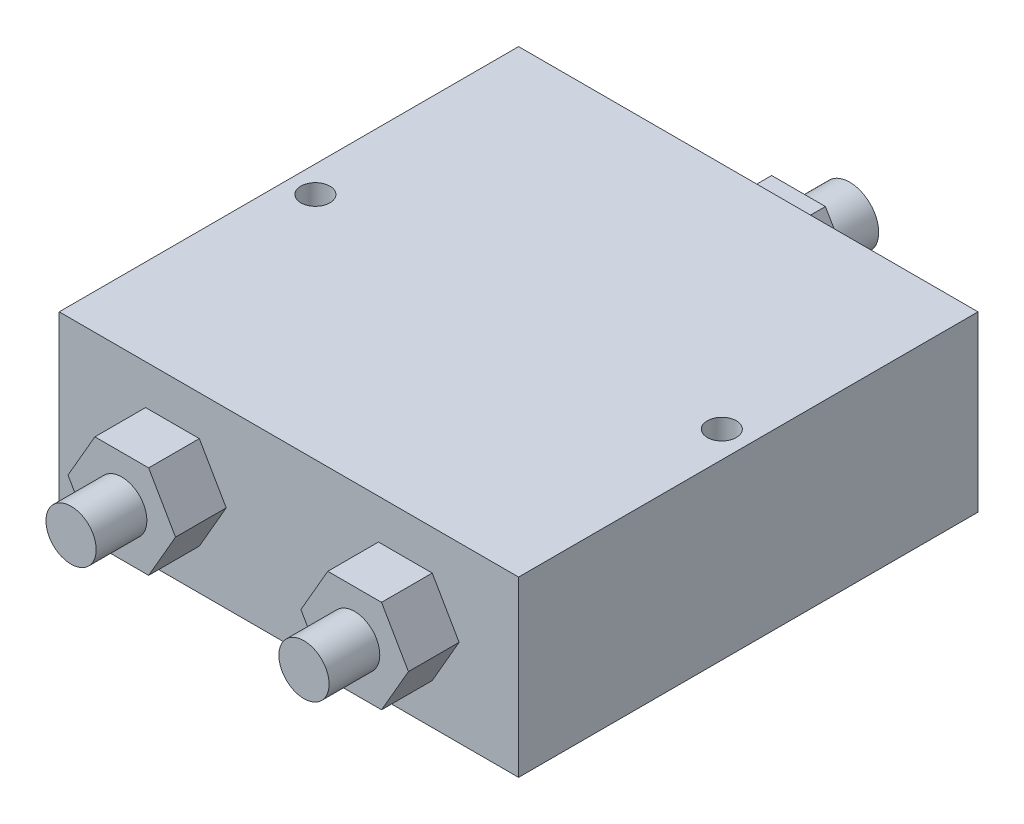
ISO-10303-21;
HEADER;
FILE_DESCRIPTION(('STEP AP214'),'2;1');
FILE_NAME('part.step','',(''),(''),'','','');
FILE_SCHEMA(('AUTOMOTIVE_DESIGN { 1 0 10303 214 1 1 1 1 }'));
ENDSEC;
DATA;
#1=APPLICATION_CONTEXT('core data for automotive mechanical design processes');
#2=APPLICATION_PROTOCOL_DEFINITION('international standard','automotive_design',2000,#1);
#3=PRODUCT_CONTEXT('',#1,'mechanical');
#4=PRODUCT('Part','Part','',(#3));
#5=PRODUCT_RELATED_PRODUCT_CATEGORY('part','',(#4));
#6=PRODUCT_DEFINITION_FORMATION('','',#4);
#7=PRODUCT_DEFINITION_CONTEXT('part definition',#1,'design');
#8=PRODUCT_DEFINITION('design','',#6,#7);
#9=PRODUCT_DEFINITION_SHAPE('','',#8);
#10=(LENGTH_UNIT() NAMED_UNIT(*) SI_UNIT(.MILLI.,.METRE.));
#11=(NAMED_UNIT(*) PLANE_ANGLE_UNIT() SI_UNIT($,.RADIAN.));
#12=(NAMED_UNIT(*) SI_UNIT($,.STERADIAN.) SOLID_ANGLE_UNIT());
#13=UNCERTAINTY_MEASURE_WITH_UNIT(LENGTH_MEASURE(1.E-05),#10,'distance_accuracy_value','');
#14=(GEOMETRIC_REPRESENTATION_CONTEXT(3) GLOBAL_UNCERTAINTY_ASSIGNED_CONTEXT((#13)) GLOBAL_UNIT_ASSIGNED_CONTEXT((#10,
#11,#12)) REPRESENTATION_CONTEXT('',''));
#15=CARTESIAN_POINT('',(0.,0.,0.));
#16=DIRECTION('',(0.,0.,1.));
#17=DIRECTION('',(1.,0.,0.));
#18=AXIS2_PLACEMENT_3D('',#15,#16,#17);
#19=CARTESIAN_POINT('',(0.,19.,0.));
#20=DIRECTION('',(0.,1.,0.));
#21=DIRECTION('',(0.,0.,1.));
#22=AXIS2_PLACEMENT_3D('',#19,#20,#21);
#23=PLANE('',#22);
#24=DIRECTION('',(0.,0.,1.));
#25=VECTOR('',#24,1.);
#26=CARTESIAN_POINT('',(-25.15,19.,25.15));
#27=LINE('',#26,#25);
#28=CARTESIAN_POINT('',(-25.15,19.,-25.15));
#29=VERTEX_POINT('',#28);
#30=CARTESIAN_POINT('',(-25.15,19.,25.15));
#31=VERTEX_POINT('',#30);
#32=EDGE_CURVE('E309',#29,#31,#27,.T.);
#33=ORIENTED_EDGE('',*,*,#32,.T.);
#34=DIRECTION('',(1.,0.,0.));
#35=VECTOR('',#34,1.);
#36=CARTESIAN_POINT('',(25.15,19.,25.15));
#37=LINE('',#36,#35);
#38=CARTESIAN_POINT('',(25.15,19.,25.15));
#39=VERTEX_POINT('',#38);
#40=EDGE_CURVE('E312',#31,#39,#37,.T.);
#41=ORIENTED_EDGE('',*,*,#40,.T.);
#42=DIRECTION('',(0.,0.,-1.));
#43=VECTOR('',#42,1.);
#44=CARTESIAN_POINT('',(25.15,19.,25.15));
#45=LINE('',#44,#43);
#46=CARTESIAN_POINT('',(25.15,19.,-25.15));
#47=VERTEX_POINT('',#46);
#48=EDGE_CURVE('E315',#39,#47,#45,.T.);
#49=ORIENTED_EDGE('',*,*,#48,.T.);
#50=DIRECTION('',(-1.,0.,0.));
#51=VECTOR('',#50,1.);
#52=CARTESIAN_POINT('',(25.15,19.,-25.15));
#53=LINE('',#52,#51);
#54=EDGE_CURVE('E317',#47,#29,#53,.T.);
#55=ORIENTED_EDGE('',*,*,#54,.T.);
#56=EDGE_LOOP('',(#33,#41,#49,#55));
#57=FACE_BOUND('',#56,.T.);
#58=CARTESIAN_POINT('',(-22.25,19.,0.));
#59=DIRECTION('',(0.,1.,0.));
#60=DIRECTION('',(0.,0.,1.));
#61=AXIS2_PLACEMENT_3D('',#58,#59,#60);
#62=CIRCLE('',#61,1.59);
#63=CARTESIAN_POINT('',(-22.25,19.,1.59));
#64=VERTEX_POINT('',#63);
#65=EDGE_CURVE('E363',#64,#64,#62,.T.);
#66=ORIENTED_EDGE('',*,*,#65,.F.);
#67=EDGE_LOOP('',(#66));
#68=FACE_BOUND('',#67,.T.);
#69=CARTESIAN_POINT('',(22.25,19.,0.));
#70=DIRECTION('',(0.,-1.,0.));
#71=DIRECTION('',(0.,0.,-1.));
#72=AXIS2_PLACEMENT_3D('',#69,#70,#71);
#73=CIRCLE('',#72,1.59);
#74=CARTESIAN_POINT('',(22.25,19.,-1.59));
#75=VERTEX_POINT('',#74);
#76=EDGE_CURVE('E366',#75,#75,#73,.T.);
#77=ORIENTED_EDGE('',*,*,#76,.T.);
#78=EDGE_LOOP('',(#77));
#79=FACE_BOUND('',#78,.T.);
#80=ADVANCED_FACE('F34',(#57,#68,#79),#23,.T.);
#81=CARTESIAN_POINT('',(0.,0.,0.));
#82=DIRECTION('',(0.,1.,0.));
#83=DIRECTION('',(0.,0.,1.));
#84=AXIS2_PLACEMENT_3D('',#81,#82,#83);
#85=PLANE('',#84);
#86=DIRECTION('',(0.,0.,1.));
#87=VECTOR('',#86,1.);
#88=CARTESIAN_POINT('',(-25.15,0.,25.15));
#89=LINE('',#88,#87);
#90=CARTESIAN_POINT('',(-25.15,0.,-25.15));
#91=VERTEX_POINT('',#90);
#92=CARTESIAN_POINT('',(-25.15,0.,25.15));
#93=VERTEX_POINT('',#92);
#94=EDGE_CURVE('E308',#91,#93,#89,.T.);
#95=ORIENTED_EDGE('',*,*,#94,.F.);
#96=DIRECTION('',(-1.,0.,0.));
#97=VECTOR('',#96,1.);
#98=CARTESIAN_POINT('',(25.15,0.,-25.15));
#99=LINE('',#98,#97);
#100=CARTESIAN_POINT('',(25.15,0.,-25.15));
#101=VERTEX_POINT('',#100);
#102=EDGE_CURVE('E313',#101,#91,#99,.T.);
#103=ORIENTED_EDGE('',*,*,#102,.F.);
#104=DIRECTION('',(0.,0.,-1.));
#105=VECTOR('',#104,1.);
#106=CARTESIAN_POINT('',(25.15,0.,25.15));
#107=LINE('',#106,#105);
#108=CARTESIAN_POINT('',(25.15,0.,25.15));
#109=VERTEX_POINT('',#108);
#110=EDGE_CURVE('E324',#109,#101,#107,.T.);
#111=ORIENTED_EDGE('',*,*,#110,.F.);
#112=DIRECTION('',(1.,0.,0.));
#113=VECTOR('',#112,1.);
#114=CARTESIAN_POINT('',(25.15,0.,25.15));
#115=LINE('',#114,#113);
#116=EDGE_CURVE('E322',#93,#109,#115,.T.);
#117=ORIENTED_EDGE('',*,*,#116,.F.);
#118=EDGE_LOOP('',(#95,#103,#111,#117));
#119=FACE_BOUND('',#118,.T.);
#120=CARTESIAN_POINT('',(-22.25,0.,0.));
#121=DIRECTION('',(0.,1.,0.));
#122=DIRECTION('',(0.,0.,1.));
#123=AXIS2_PLACEMENT_3D('',#120,#121,#122);
#124=CIRCLE('',#123,1.59);
#125=CARTESIAN_POINT('',(-22.25,0.,1.59));
#126=VERTEX_POINT('',#125);
#127=EDGE_CURVE('E370',#126,#126,#124,.T.);
#128=ORIENTED_EDGE('',*,*,#127,.T.);
#129=EDGE_LOOP('',(#128));
#130=FACE_BOUND('',#129,.T.);
#131=CARTESIAN_POINT('',(22.25,0.,0.));
#132=DIRECTION('',(0.,-1.,0.));
#133=DIRECTION('',(0.,0.,-1.));
#134=AXIS2_PLACEMENT_3D('',#131,#132,#133);
#135=CIRCLE('',#134,1.59);
#136=CARTESIAN_POINT('',(22.25,0.,-1.59));
#137=VERTEX_POINT('',#136);
#138=EDGE_CURVE('E368',#137,#137,#135,.T.);
#139=ORIENTED_EDGE('',*,*,#138,.F.);
#140=EDGE_LOOP('',(#139));
#141=FACE_BOUND('',#140,.T.);
#142=ADVANCED_FACE('F346',(#119,#130,#141),#85,.F.);
#143=CARTESIAN_POINT('',(0.,0.,30.7));
#144=DIRECTION('',(0.,0.,1.));
#145=DIRECTION('',(1.,0.,0.));
#146=AXIS2_PLACEMENT_3D('',#143,#144,#145);
#147=PLANE('',#146);
#148=DIRECTION('',(-0.5,-0.866025403784439,0.));
#149=VECTOR('',#148,1.);
#150=CARTESIAN_POINT('',(-18.112863606784,10.4574666791717,30.7));
#151=LINE('',#150,#149);
#152=CARTESIAN_POINT('',(-15.6928784028185,14.6490040060048,30.7));
#153=VERTEX_POINT('',#152);
#154=CARTESIAN_POINT('',(-18.6357568056371,9.55178909182594,30.7));
#155=VERTEX_POINT('',#154);
#156=EDGE_CURVE('E260',#153,#155,#151,.T.);
#157=ORIENTED_EDGE('',*,*,#156,.T.);
#158=DIRECTION('',(0.500000000000001,-0.866025403784438,0.));
#159=VECTOR('',#158,1.);
#160=CARTESIAN_POINT('',(-9.84077160167162,-5.68157213325874,30.7));
#161=LINE('',#160,#159);
#162=CARTESIAN_POINT('',(-15.6928784028185,4.45457417764707,30.7));
#163=VERTEX_POINT('',#162);
#164=EDGE_CURVE('E263',#155,#163,#161,.T.);
#165=ORIENTED_EDGE('',*,*,#164,.T.);
#166=DIRECTION('',(1.,0.,0.));
#167=VECTOR('',#166,1.);
#168=CARTESIAN_POINT('',(0.,4.45457417764707,30.7));
#169=LINE('',#168,#167);
#170=CARTESIAN_POINT('',(-9.80712159718144,4.45457417764707,30.7));
#171=VERTEX_POINT('',#170);
#172=EDGE_CURVE('E266',#163,#171,#169,.T.);
#173=ORIENTED_EDGE('',*,*,#172,.T.);
#174=DIRECTION('',(0.5,0.866025403784439,0.));
#175=VECTOR('',#174,1.);
#176=CARTESIAN_POINT('',(-9.28422839832835,5.36025176499284,30.7));
#177=LINE('',#176,#175);
#178=CARTESIAN_POINT('',(-6.86424319436289,9.55178909182595,30.7));
#179=VERTEX_POINT('',#178);
#180=EDGE_CURVE('E268',#171,#179,#177,.T.);
#181=ORIENTED_EDGE('',*,*,#180,.T.);
#182=DIRECTION('',(-0.5,0.866025403784438,0.));
#183=VECTOR('',#182,1.);
#184=CARTESIAN_POINT('',(-1.01213639321598,-0.584357219079866,30.7));
#185=LINE('',#184,#183);
#186=CARTESIAN_POINT('',(-9.80712159718144,14.6490040060048,30.7));
#187=VERTEX_POINT('',#186);
#188=EDGE_CURVE('E270',#179,#187,#185,.T.);
#189=ORIENTED_EDGE('',*,*,#188,.T.);
#190=DIRECTION('',(-1.,0.,0.));
#191=VECTOR('',#190,1.);
#192=CARTESIAN_POINT('',(0.,14.6490040060048,30.7));
#193=LINE('',#192,#191);
#194=EDGE_CURVE('E272',#187,#153,#193,.T.);
#195=ORIENTED_EDGE('',*,*,#194,.T.);
#196=EDGE_LOOP('',(#157,#165,#173,#181,#189,#195));
#197=FACE_BOUND('',#196,.T.);
#198=CARTESIAN_POINT('',(-12.7507568056371,9.56400400600482,30.7));
#199=DIRECTION('',(0.,0.,1.));
#200=DIRECTION('',(1.,0.,0.));
#201=AXIS2_PLACEMENT_3D('',#198,#199,#200);
#202=CIRCLE('',#201,2.75);
#203=CARTESIAN_POINT('',(-10.0007568056371,9.56400400600482,30.7));
#204=VERTEX_POINT('',#203);
#205=EDGE_CURVE('E380',#204,#204,#202,.T.);
#206=ORIENTED_EDGE('',*,*,#205,.F.);
#207=EDGE_LOOP('',(#206));
#208=FACE_BOUND('',#207,.T.);
#209=ADVANCED_FACE('F437',(#197,#208),#147,.T.);
#210=CARTESIAN_POINT('',(0.,0.,-30.7));
#211=DIRECTION('',(0.,0.,-1.));
#212=DIRECTION('',(-1.,0.,0.));
#213=AXIS2_PLACEMENT_3D('',#210,#211,#212);
#214=PLANE('',#213);
#215=DIRECTION('',(0.5,-0.866025403784439,0.));
#216=VECTOR('',#215,1.);
#217=CARTESIAN_POINT('',(2.89275432205953,15.0813788669719,-30.7));
#218=LINE('',#217,#216);
#219=CARTESIAN_POINT('',(2.89275432205953,15.0813788669719,-30.7));
#220=VERTEX_POINT('',#219);
#221=CARTESIAN_POINT('',(5.83550864411906,9.98437886697185,-30.7));
#222=VERTEX_POINT('',#221);
#223=EDGE_CURVE('E191',#220,#222,#218,.T.);
#224=ORIENTED_EDGE('',*,*,#223,.T.);
#225=DIRECTION('',(-0.5,-0.866025403784439,0.));
#226=VECTOR('',#225,1.);
#227=CARTESIAN_POINT('',(5.83550864411906,9.98437886697185,-30.7));
#228=LINE('',#227,#226);
#229=CARTESIAN_POINT('',(2.89275432205953,4.88737886697185,-30.7));
#230=VERTEX_POINT('',#229);
#231=EDGE_CURVE('E180',#222,#230,#228,.T.);
#232=ORIENTED_EDGE('',*,*,#231,.T.);
#233=DIRECTION('',(-1.,0.,0.));
#234=VECTOR('',#233,1.);
#235=CARTESIAN_POINT('',(2.89275432205953,4.88737886697185,-30.7));
#236=LINE('',#235,#234);
#237=CARTESIAN_POINT('',(-2.99275432205951,4.88737886697185,-30.7));
#238=VERTEX_POINT('',#237);
#239=EDGE_CURVE('E190',#230,#238,#236,.T.);
#240=ORIENTED_EDGE('',*,*,#239,.T.);
#241=DIRECTION('',(-0.5,0.866025403784439,0.));
#242=VECTOR('',#241,1.);
#243=CARTESIAN_POINT('',(-2.99275432205951,4.88737886697185,-30.7));
#244=LINE('',#243,#242);
#245=CARTESIAN_POINT('',(-5.93550864411904,9.98437886697186,-30.7));
#246=VERTEX_POINT('',#245);
#247=EDGE_CURVE('E393',#238,#246,#244,.T.);
#248=ORIENTED_EDGE('',*,*,#247,.T.);
#249=DIRECTION('',(0.5,0.866025403784439,0.));
#250=VECTOR('',#249,1.);
#251=CARTESIAN_POINT('',(-5.93550864411904,9.98437886697186,-30.7));
#252=LINE('',#251,#250);
#253=CARTESIAN_POINT('',(-2.99275432205951,15.0813788669719,-30.7));
#254=VERTEX_POINT('',#253);
#255=EDGE_CURVE('E395',#246,#254,#252,.T.);
#256=ORIENTED_EDGE('',*,*,#255,.T.);
#257=DIRECTION('',(1.,0.,0.));
#258=VECTOR('',#257,1.);
#259=CARTESIAN_POINT('',(-2.99275432205951,15.0813788669719,-30.7));
#260=LINE('',#259,#258);
#261=EDGE_CURVE('E197',#254,#220,#260,.T.);
#262=ORIENTED_EDGE('',*,*,#261,.T.);
#263=EDGE_LOOP('',(#224,#232,#240,#248,#256,#262));
#264=FACE_BOUND('',#263,.T.);
#265=CARTESIAN_POINT('',(0.,9.99637886697186,-30.7));
#266=DIRECTION('',(0.,0.,-1.));
#267=DIRECTION('',(-1.,0.,0.));
#268=AXIS2_PLACEMENT_3D('',#265,#266,#267);
#269=CIRCLE('',#268,3.175);
#270=CARTESIAN_POINT('',(-3.175,9.99637886697186,-30.7));
#271=VERTEX_POINT('',#270);
#272=EDGE_CURVE('E384',#271,#271,#269,.T.);
#273=ORIENTED_EDGE('',*,*,#272,.F.);
#274=EDGE_LOOP('',(#273));
#275=FACE_BOUND('',#274,.T.);
#276=ADVANCED_FACE('F194',(#264,#275),#214,.T.);
#277=CARTESIAN_POINT('',(25.15,19.,-25.15));
#278=DIRECTION('',(0.,0.,1.));
#279=DIRECTION('',(1.,0.,0.));
#280=AXIS2_PLACEMENT_3D('',#277,#278,#279);
#281=PLANE('',#280);
#282=ORIENTED_EDGE('',*,*,#102,.T.);
#283=DIRECTION('',(0.,-1.,0.));
#284=VECTOR('',#283,1.);
#285=CARTESIAN_POINT('',(-25.15,19.,-25.15));
#286=LINE('',#285,#284);
#287=EDGE_CURVE('E319',#29,#91,#286,.T.);
#288=ORIENTED_EDGE('',*,*,#287,.F.);
#289=ORIENTED_EDGE('',*,*,#54,.F.);
#290=DIRECTION('',(0.,-1.,0.));
#291=VECTOR('',#290,1.);
#292=CARTESIAN_POINT('',(25.15,19.,-25.15));
#293=LINE('',#292,#291);
#294=EDGE_CURVE('E329',#47,#101,#293,.T.);
#295=ORIENTED_EDGE('',*,*,#294,.T.);
#296=EDGE_LOOP('',(#282,#288,#289,#295));
#297=FACE_BOUND('',#296,.T.);
#298=DIRECTION('',(0.5,-0.866025403784439,0.));
#299=VECTOR('',#298,1.);
#300=CARTESIAN_POINT('',(2.89275432205953,15.0813788669719,-25.15));
#301=LINE('',#300,#299);
#302=CARTESIAN_POINT('',(2.89275432205953,15.0813788669719,-25.15));
#303=VERTEX_POINT('',#302);
#304=CARTESIAN_POINT('',(5.83550864411905,9.98437886697185,-25.15));
#305=VERTEX_POINT('',#304);
#306=EDGE_CURVE('E204',#303,#305,#301,.T.);
#307=ORIENTED_EDGE('',*,*,#306,.F.);
#308=DIRECTION('',(1.,0.,0.));
#309=VECTOR('',#308,1.);
#310=CARTESIAN_POINT('',(-2.99275432205951,15.0813788669719,-25.15));
#311=LINE('',#310,#309);
#312=CARTESIAN_POINT('',(-2.99275432205951,15.0813788669719,-25.15));
#313=VERTEX_POINT('',#312);
#314=EDGE_CURVE('E201',#313,#303,#311,.T.);
#315=ORIENTED_EDGE('',*,*,#314,.F.);
#316=DIRECTION('',(0.5,0.866025403784439,0.));
#317=VECTOR('',#316,1.);
#318=CARTESIAN_POINT('',(-5.93550864411903,9.98437886697186,-25.15));
#319=LINE('',#318,#317);
#320=CARTESIAN_POINT('',(-5.93550864411904,9.98437886697185,-25.15));
#321=VERTEX_POINT('',#320);
#322=EDGE_CURVE('E405',#321,#313,#319,.T.);
#323=ORIENTED_EDGE('',*,*,#322,.F.);
#324=DIRECTION('',(-0.5,0.866025403784439,0.));
#325=VECTOR('',#324,1.);
#326=CARTESIAN_POINT('',(-2.99275432205951,4.88737886697185,-25.15));
#327=LINE('',#326,#325);
#328=CARTESIAN_POINT('',(-2.99275432205952,4.88737886697185,-25.15));
#329=VERTEX_POINT('',#328);
#330=EDGE_CURVE('E402',#329,#321,#327,.T.);
#331=ORIENTED_EDGE('',*,*,#330,.F.);
#332=DIRECTION('',(-1.,0.,0.));
#333=VECTOR('',#332,1.);
#334=CARTESIAN_POINT('',(2.89275432205953,4.88737886697185,-25.15));
#335=LINE('',#334,#333);
#336=CARTESIAN_POINT('',(2.89275432205953,4.88737886697185,-25.15));
#337=VERTEX_POINT('',#336);
#338=EDGE_CURVE('E54',#337,#329,#335,.T.);
#339=ORIENTED_EDGE('',*,*,#338,.F.);
#340=DIRECTION('',(-0.5,-0.866025403784439,0.));
#341=VECTOR('',#340,1.);
#342=CARTESIAN_POINT('',(5.83550864411906,9.98437886697185,-25.15));
#343=LINE('',#342,#341);
#344=EDGE_CURVE('E49',#305,#337,#343,.T.);
#345=ORIENTED_EDGE('',*,*,#344,.F.);
#346=EDGE_LOOP('',(#307,#315,#323,#331,#339,#345));
#347=FACE_BOUND('',#346,.T.);
#348=ADVANCED_FACE('F355',(#297,#347),#281,.F.);
#349=CARTESIAN_POINT('',(25.15,19.,25.15));
#350=DIRECTION('',(0.,0.,-1.));
#351=DIRECTION('',(-1.,0.,0.));
#352=AXIS2_PLACEMENT_3D('',#349,#350,#351);
#353=PLANE('',#352);
#354=DIRECTION('',(0.5,-0.866025403784439,0.));
#355=VECTOR('',#354,1.);
#356=CARTESIAN_POINT('',(18.112863606784,10.4574666791717,25.15));
#357=LINE('',#356,#355);
#358=CARTESIAN_POINT('',(15.6928784028185,14.6490040060048,25.15));
#359=VERTEX_POINT('',#358);
#360=CARTESIAN_POINT('',(18.6357568056371,9.55178909182595,25.15));
#361=VERTEX_POINT('',#360);
#362=EDGE_CURVE('E208',#359,#361,#357,.T.);
#363=ORIENTED_EDGE('',*,*,#362,.T.);
#364=DIRECTION('',(-0.5,-0.866025403784439,0.));
#365=VECTOR('',#364,1.);
#366=CARTESIAN_POINT('',(9.84077160167165,-5.68157213325875,25.15));
#367=LINE('',#366,#365);
#368=CARTESIAN_POINT('',(15.6928784028186,4.45457417764708,25.15));
#369=VERTEX_POINT('',#368);
#370=EDGE_CURVE('E205',#361,#369,#367,.T.);
#371=ORIENTED_EDGE('',*,*,#370,.T.);
#372=DIRECTION('',(-1.,0.,0.));
#373=VECTOR('',#372,1.);
#374=CARTESIAN_POINT('',(0.,4.45457417764707,25.15));
#375=LINE('',#374,#373);
#376=CARTESIAN_POINT('',(9.80712159718145,4.45457417764708,25.15));
#377=VERTEX_POINT('',#376);
#378=EDGE_CURVE('E218',#369,#377,#375,.T.);
#379=ORIENTED_EDGE('',*,*,#378,.T.);
#380=DIRECTION('',(-0.5,0.866025403784438,0.));
#381=VECTOR('',#380,1.);
#382=CARTESIAN_POINT('',(9.28422839832836,5.36025176499285,25.15));
#383=LINE('',#382,#381);
#384=CARTESIAN_POINT('',(6.8642431943629,9.55178909182595,25.15));
#385=VERTEX_POINT('',#384);
#386=EDGE_CURVE('E242',#377,#385,#383,.T.);
#387=ORIENTED_EDGE('',*,*,#386,.T.);
#388=DIRECTION('',(0.5,0.866025403784439,0.));
#389=VECTOR('',#388,1.);
#390=CARTESIAN_POINT('',(1.01213639321599,-0.58435721907987,25.15));
#391=LINE('',#390,#389);
#392=CARTESIAN_POINT('',(9.80712159718145,14.6490040060048,25.15));
#393=VERTEX_POINT('',#392);
#394=EDGE_CURVE('E239',#385,#393,#391,.T.);
#395=ORIENTED_EDGE('',*,*,#394,.T.);
#396=DIRECTION('',(1.,0.,0.));
#397=VECTOR('',#396,1.);
#398=CARTESIAN_POINT('',(0.,14.6490040060048,25.15));
#399=LINE('',#398,#397);
#400=EDGE_CURVE('E236',#393,#359,#399,.T.);
#401=ORIENTED_EDGE('',*,*,#400,.T.);
#402=EDGE_LOOP('',(#363,#371,#379,#387,#395,#401));
#403=FACE_BOUND('',#402,.T.);
#404=ORIENTED_EDGE('',*,*,#116,.T.);
#405=DIRECTION('',(0.,-1.,0.));
#406=VECTOR('',#405,1.);
#407=CARTESIAN_POINT('',(25.15,19.,25.15));
#408=LINE('',#407,#406);
#409=EDGE_CURVE('E332',#39,#109,#408,.T.);
#410=ORIENTED_EDGE('',*,*,#409,.F.);
#411=ORIENTED_EDGE('',*,*,#40,.F.);
#412=DIRECTION('',(0.,-1.,0.));
#413=VECTOR('',#412,1.);
#414=CARTESIAN_POINT('',(-25.15,19.,25.15));
#415=LINE('',#414,#413);
#416=EDGE_CURVE('E42',#31,#93,#415,.T.);
#417=ORIENTED_EDGE('',*,*,#416,.T.);
#418=EDGE_LOOP('',(#404,#410,#411,#417));
#419=FACE_BOUND('',#418,.T.);
#420=DIRECTION('',(-0.5,-0.866025403784439,0.));
#421=VECTOR('',#420,1.);
#422=CARTESIAN_POINT('',(-18.112863606784,10.4574666791717,25.15));
#423=LINE('',#422,#421);
#424=CARTESIAN_POINT('',(-15.6928784028185,14.6490040060048,25.15));
#425=VERTEX_POINT('',#424);
#426=CARTESIAN_POINT('',(-18.6357568056371,9.55178909182594,25.15));
#427=VERTEX_POINT('',#426);
#428=EDGE_CURVE('E259',#425,#427,#423,.T.);
#429=ORIENTED_EDGE('',*,*,#428,.F.);
#430=DIRECTION('',(-1.,0.,0.));
#431=VECTOR('',#430,1.);
#432=CARTESIAN_POINT('',(0.,14.6490040060048,25.15));
#433=LINE('',#432,#431);
#434=CARTESIAN_POINT('',(-9.80712159718145,14.6490040060048,25.15));
#435=VERTEX_POINT('',#434);
#436=EDGE_CURVE('E264',#435,#425,#433,.T.);
#437=ORIENTED_EDGE('',*,*,#436,.F.);
#438=DIRECTION('',(-0.5,0.866025403784438,0.));
#439=VECTOR('',#438,1.);
#440=CARTESIAN_POINT('',(-1.01213639321598,-0.584357219079866,25.15));
#441=LINE('',#440,#439);
#442=CARTESIAN_POINT('',(-6.86424319436289,9.55178909182595,25.15));
#443=VERTEX_POINT('',#442);
#444=EDGE_CURVE('E286',#443,#435,#441,.T.);
#445=ORIENTED_EDGE('',*,*,#444,.F.);
#446=DIRECTION('',(0.5,0.866025403784439,0.));
#447=VECTOR('',#446,1.);
#448=CARTESIAN_POINT('',(-9.28422839832835,5.36025176499284,25.15));
#449=LINE('',#448,#447);
#450=CARTESIAN_POINT('',(-9.80712159718144,4.45457417764707,25.15));
#451=VERTEX_POINT('',#450);
#452=EDGE_CURVE('E283',#451,#443,#449,.T.);
#453=ORIENTED_EDGE('',*,*,#452,.F.);
#454=DIRECTION('',(1.,0.,0.));
#455=VECTOR('',#454,1.);
#456=CARTESIAN_POINT('',(0.,4.45457417764707,25.15));
#457=LINE('',#456,#455);
#458=CARTESIAN_POINT('',(-15.6928784028185,4.45457417764707,25.15));
#459=VERTEX_POINT('',#458);
#460=EDGE_CURVE('E280',#459,#451,#457,.T.);
#461=ORIENTED_EDGE('',*,*,#460,.F.);
#462=DIRECTION('',(0.500000000000001,-0.866025403784438,0.));
#463=VECTOR('',#462,1.);
#464=CARTESIAN_POINT('',(-9.84077160167162,-5.68157213325874,25.15));
#465=LINE('',#464,#463);
#466=EDGE_CURVE('E277',#427,#459,#465,.T.);
#467=ORIENTED_EDGE('',*,*,#466,.F.);
#468=EDGE_LOOP('',(#429,#437,#445,#453,#461,#467));
#469=FACE_BOUND('',#468,.T.);
#470=ADVANCED_FACE('F337',(#403,#419,#469),#353,.F.);
#471=CARTESIAN_POINT('',(-25.15,19.,25.15));
#472=DIRECTION('',(1.,0.,0.));
#473=DIRECTION('',(0.,0.,-1.));
#474=AXIS2_PLACEMENT_3D('',#471,#472,#473);
#475=PLANE('',#474);
#476=ORIENTED_EDGE('',*,*,#94,.T.);
#477=ORIENTED_EDGE('',*,*,#416,.F.);
#478=ORIENTED_EDGE('',*,*,#32,.F.);
#479=ORIENTED_EDGE('',*,*,#287,.T.);
#480=EDGE_LOOP('',(#476,#477,#478,#479));
#481=FACE_BOUND('',#480,.T.);
#482=ADVANCED_FACE('F36',(#481),#475,.F.);
#483=CARTESIAN_POINT('',(25.15,19.,25.15));
#484=DIRECTION('',(-1.,0.,0.));
#485=DIRECTION('',(0.,0.,1.));
#486=AXIS2_PLACEMENT_3D('',#483,#484,#485);
#487=PLANE('',#486);
#488=ORIENTED_EDGE('',*,*,#110,.T.);
#489=ORIENTED_EDGE('',*,*,#294,.F.);
#490=ORIENTED_EDGE('',*,*,#48,.F.);
#491=ORIENTED_EDGE('',*,*,#409,.T.);
#492=EDGE_LOOP('',(#488,#489,#490,#491));
#493=FACE_BOUND('',#492,.T.);
#494=ADVANCED_FACE('F351',(#493),#487,.F.);
#495=CARTESIAN_POINT('',(-18.112863606784,10.4574666791717,30.7));
#496=DIRECTION('',(0.866025403784439,-0.5,0.));
#497=DIRECTION('',(0.5,0.866025403784439,0.));
#498=AXIS2_PLACEMENT_3D('',#495,#496,#497);
#499=PLANE('',#498);
#500=ORIENTED_EDGE('',*,*,#428,.T.);
#501=DIRECTION('',(0.,0.,-1.));
#502=VECTOR('',#501,1.);
#503=CARTESIAN_POINT('',(-18.6357568056371,9.55178909182594,30.7));
#504=LINE('',#503,#502);
#505=EDGE_CURVE('E305',#155,#427,#504,.T.);
#506=ORIENTED_EDGE('',*,*,#505,.F.);
#507=ORIENTED_EDGE('',*,*,#156,.F.);
#508=DIRECTION('',(0.,0.,-1.));
#509=VECTOR('',#508,1.);
#510=CARTESIAN_POINT('',(-15.6928784028185,14.6490040060048,30.7));
#511=LINE('',#510,#509);
#512=EDGE_CURVE('E274',#153,#425,#511,.T.);
#513=ORIENTED_EDGE('',*,*,#512,.T.);
#514=EDGE_LOOP('',(#500,#506,#507,#513));
#515=FACE_BOUND('',#514,.T.);
#516=ADVANCED_FACE('F442',(#515),#499,.F.);
#517=CARTESIAN_POINT('',(-9.84077160167162,-5.68157213325874,30.7));
#518=DIRECTION('',(0.866025403784438,0.500000000000001,0.));
#519=DIRECTION('',(-0.500000000000001,0.866025403784438,0.));
#520=AXIS2_PLACEMENT_3D('',#517,#518,#519);
#521=PLANE('',#520);
#522=ORIENTED_EDGE('',*,*,#466,.T.);
#523=DIRECTION('',(0.,0.,-1.));
#524=VECTOR('',#523,1.);
#525=CARTESIAN_POINT('',(-15.6928784028185,4.45457417764707,30.7));
#526=LINE('',#525,#524);
#527=EDGE_CURVE('E302',#163,#459,#526,.T.);
#528=ORIENTED_EDGE('',*,*,#527,.F.);
#529=ORIENTED_EDGE('',*,*,#164,.F.);
#530=ORIENTED_EDGE('',*,*,#505,.T.);
#531=EDGE_LOOP('',(#522,#528,#529,#530));
#532=FACE_BOUND('',#531,.T.);
#533=ADVANCED_FACE('F447',(#532),#521,.F.);
#534=CARTESIAN_POINT('',(0.,4.45457417764707,30.7));
#535=DIRECTION('',(0.,1.,0.));
#536=DIRECTION('',(0.,0.,1.));
#537=AXIS2_PLACEMENT_3D('',#534,#535,#536);
#538=PLANE('',#537);
#539=ORIENTED_EDGE('',*,*,#460,.T.);
#540=DIRECTION('',(0.,0.,-1.));
#541=VECTOR('',#540,1.);
#542=CARTESIAN_POINT('',(-9.80712159718144,4.45457417764707,30.7));
#543=LINE('',#542,#541);
#544=EDGE_CURVE('E299',#171,#451,#543,.T.);
#545=ORIENTED_EDGE('',*,*,#544,.F.);
#546=ORIENTED_EDGE('',*,*,#172,.F.);
#547=ORIENTED_EDGE('',*,*,#527,.T.);
#548=EDGE_LOOP('',(#539,#545,#546,#547));
#549=FACE_BOUND('',#548,.T.);
#550=ADVANCED_FACE('F473',(#549),#538,.F.);
#551=CARTESIAN_POINT('',(-9.28422839832835,5.36025176499284,30.7));
#552=DIRECTION('',(-0.866025403784439,0.5,0.));
#553=DIRECTION('',(-0.5,-0.866025403784439,0.));
#554=AXIS2_PLACEMENT_3D('',#551,#552,#553);
#555=PLANE('',#554);
#556=ORIENTED_EDGE('',*,*,#452,.T.);
#557=DIRECTION('',(0.,0.,-1.));
#558=VECTOR('',#557,1.);
#559=CARTESIAN_POINT('',(-6.86424319436289,9.55178909182595,30.7));
#560=LINE('',#559,#558);
#561=EDGE_CURVE('E296',#179,#443,#560,.T.);
#562=ORIENTED_EDGE('',*,*,#561,.F.);
#563=ORIENTED_EDGE('',*,*,#180,.F.);
#564=ORIENTED_EDGE('',*,*,#544,.T.);
#565=EDGE_LOOP('',(#556,#562,#563,#564));
#566=FACE_BOUND('',#565,.T.);
#567=ADVANCED_FACE('F483',(#566),#555,.F.);
#568=CARTESIAN_POINT('',(-1.01213639321598,-0.584357219079866,30.7));
#569=DIRECTION('',(-0.866025403784438,-0.5,0.));
#570=DIRECTION('',(0.5,-0.866025403784438,0.));
#571=AXIS2_PLACEMENT_3D('',#568,#569,#570);
#572=PLANE('',#571);
#573=ORIENTED_EDGE('',*,*,#444,.T.);
#574=DIRECTION('',(0.,0.,-1.));
#575=VECTOR('',#574,1.);
#576=CARTESIAN_POINT('',(-9.80712159718144,14.6490040060048,30.7));
#577=LINE('',#576,#575);
#578=EDGE_CURVE('E293',#187,#435,#577,.T.);
#579=ORIENTED_EDGE('',*,*,#578,.F.);
#580=ORIENTED_EDGE('',*,*,#188,.F.);
#581=ORIENTED_EDGE('',*,*,#561,.T.);
#582=EDGE_LOOP('',(#573,#579,#580,#581));
#583=FACE_BOUND('',#582,.T.);
#584=ADVANCED_FACE('F493',(#583),#572,.F.);
#585=CARTESIAN_POINT('',(0.,14.6490040060048,30.7));
#586=DIRECTION('',(0.,-1.,0.));
#587=DIRECTION('',(0.,0.,-1.));
#588=AXIS2_PLACEMENT_3D('',#585,#586,#587);
#589=PLANE('',#588);
#590=ORIENTED_EDGE('',*,*,#436,.T.);
#591=ORIENTED_EDGE('',*,*,#512,.F.);
#592=ORIENTED_EDGE('',*,*,#194,.F.);
#593=ORIENTED_EDGE('',*,*,#578,.T.);
#594=EDGE_LOOP('',(#590,#591,#592,#593));
#595=FACE_BOUND('',#594,.T.);
#596=ADVANCED_FACE('F503',(#595),#589,.F.);
#597=CARTESIAN_POINT('',(9.84077160167165,-5.68157213325875,30.7));
#598=DIRECTION('',(0.866025403784439,-0.5,0.));
#599=DIRECTION('',(0.5,0.866025403784439,0.));
#600=AXIS2_PLACEMENT_3D('',#597,#598,#599);
#601=PLANE('',#600);
#602=ORIENTED_EDGE('',*,*,#370,.F.);
#603=DIRECTION('',(0.,0.,-1.));
#604=VECTOR('',#603,1.);
#605=CARTESIAN_POINT('',(18.6357568056371,9.55178909182595,30.7));
#606=LINE('',#605,#604);
#607=CARTESIAN_POINT('',(18.6357568056371,9.55178909182595,30.7));
#608=VERTEX_POINT('',#607);
#609=EDGE_CURVE('E257',#608,#361,#606,.T.);
#610=ORIENTED_EDGE('',*,*,#609,.F.);
#611=DIRECTION('',(-0.5,-0.866025403784439,0.));
#612=VECTOR('',#611,1.);
#613=CARTESIAN_POINT('',(9.84077160167165,-5.68157213325875,30.7));
#614=LINE('',#613,#612);
#615=CARTESIAN_POINT('',(15.6928784028186,4.45457417764708,30.7));
#616=VERTEX_POINT('',#615);
#617=EDGE_CURVE('E214',#608,#616,#614,.T.);
#618=ORIENTED_EDGE('',*,*,#617,.T.);
#619=DIRECTION('',(0.,0.,-1.));
#620=VECTOR('',#619,1.);
#621=CARTESIAN_POINT('',(15.6928784028186,4.45457417764708,30.7));
#622=LINE('',#621,#620);
#623=EDGE_CURVE('E232',#616,#369,#622,.T.);
#624=ORIENTED_EDGE('',*,*,#623,.T.);
#625=EDGE_LOOP('',(#602,#610,#618,#624));
#626=FACE_BOUND('',#625,.T.);
#627=ADVANCED_FACE('F513',(#626),#601,.T.);
#628=CARTESIAN_POINT('',(18.112863606784,10.4574666791717,30.7));
#629=DIRECTION('',(0.866025403784439,0.5,0.));
#630=DIRECTION('',(-0.5,0.866025403784439,0.));
#631=AXIS2_PLACEMENT_3D('',#628,#629,#630);
#632=PLANE('',#631);
#633=ORIENTED_EDGE('',*,*,#362,.F.);
#634=DIRECTION('',(0.,0.,-1.));
#635=VECTOR('',#634,1.);
#636=CARTESIAN_POINT('',(15.6928784028185,14.6490040060048,30.7));
#637=LINE('',#636,#635);
#638=CARTESIAN_POINT('',(15.6928784028185,14.6490040060048,30.7));
#639=VERTEX_POINT('',#638);
#640=EDGE_CURVE('E255',#639,#359,#637,.T.);
#641=ORIENTED_EDGE('',*,*,#640,.F.);
#642=DIRECTION('',(0.5,-0.866025403784439,0.));
#643=VECTOR('',#642,1.);
#644=CARTESIAN_POINT('',(18.112863606784,10.4574666791717,30.7));
#645=LINE('',#644,#643);
#646=EDGE_CURVE('E217',#639,#608,#645,.T.);
#647=ORIENTED_EDGE('',*,*,#646,.T.);
#648=ORIENTED_EDGE('',*,*,#609,.T.);
#649=EDGE_LOOP('',(#633,#641,#647,#648));
#650=FACE_BOUND('',#649,.T.);
#651=ADVANCED_FACE('F523',(#650),#632,.T.);
#652=CARTESIAN_POINT('',(0.,14.6490040060048,30.7));
#653=DIRECTION('',(0.,1.,0.));
#654=DIRECTION('',(-1.,0.,0.));
#655=AXIS2_PLACEMENT_3D('',#652,#653,#654);
#656=PLANE('',#655);
#657=ORIENTED_EDGE('',*,*,#400,.F.);
#658=DIRECTION('',(0.,0.,-1.));
#659=VECTOR('',#658,1.);
#660=CARTESIAN_POINT('',(9.80712159718145,14.6490040060048,30.7));
#661=LINE('',#660,#659);
#662=CARTESIAN_POINT('',(9.80712159718145,14.6490040060048,30.7));
#663=VERTEX_POINT('',#662);
#664=EDGE_CURVE('E253',#663,#393,#661,.T.);
#665=ORIENTED_EDGE('',*,*,#664,.F.);
#666=DIRECTION('',(1.,0.,0.));
#667=VECTOR('',#666,1.);
#668=CARTESIAN_POINT('',(0.,14.6490040060048,30.7));
#669=LINE('',#668,#667);
#670=EDGE_CURVE('E221',#663,#639,#669,.T.);
#671=ORIENTED_EDGE('',*,*,#670,.T.);
#672=ORIENTED_EDGE('',*,*,#640,.T.);
#673=EDGE_LOOP('',(#657,#665,#671,#672));
#674=FACE_BOUND('',#673,.T.);
#675=ADVANCED_FACE('F533',(#674),#656,.T.);
#676=CARTESIAN_POINT('',(1.01213639321599,-0.58435721907987,30.7));
#677=DIRECTION('',(-0.866025403784439,0.5,0.));
#678=DIRECTION('',(-0.5,-0.866025403784439,0.));
#679=AXIS2_PLACEMENT_3D('',#676,#677,#678);
#680=PLANE('',#679);
#681=ORIENTED_EDGE('',*,*,#394,.F.);
#682=DIRECTION('',(0.,0.,-1.));
#683=VECTOR('',#682,1.);
#684=CARTESIAN_POINT('',(6.8642431943629,9.55178909182595,30.7));
#685=LINE('',#684,#683);
#686=CARTESIAN_POINT('',(6.8642431943629,9.55178909182595,30.7));
#687=VERTEX_POINT('',#686);
#688=EDGE_CURVE('E251',#687,#385,#685,.T.);
#689=ORIENTED_EDGE('',*,*,#688,.F.);
#690=DIRECTION('',(0.5,0.866025403784439,0.));
#691=VECTOR('',#690,1.);
#692=CARTESIAN_POINT('',(1.01213639321599,-0.58435721907987,30.7));
#693=LINE('',#692,#691);
#694=EDGE_CURVE('E224',#687,#663,#693,.T.);
#695=ORIENTED_EDGE('',*,*,#694,.T.);
#696=ORIENTED_EDGE('',*,*,#664,.T.);
#697=EDGE_LOOP('',(#681,#689,#695,#696));
#698=FACE_BOUND('',#697,.T.);
#699=ADVANCED_FACE('F543',(#698),#680,.T.);
#700=CARTESIAN_POINT('',(9.28422839832836,5.36025176499285,30.7));
#701=DIRECTION('',(-0.866025403784438,-0.5,0.));
#702=DIRECTION('',(0.5,-0.866025403784438,0.));
#703=AXIS2_PLACEMENT_3D('',#700,#701,#702);
#704=PLANE('',#703);
#705=ORIENTED_EDGE('',*,*,#386,.F.);
#706=DIRECTION('',(0.,0.,-1.));
#707=VECTOR('',#706,1.);
#708=CARTESIAN_POINT('',(9.80712159718145,4.45457417764708,30.7));
#709=LINE('',#708,#707);
#710=CARTESIAN_POINT('',(9.80712159718145,4.45457417764708,30.7));
#711=VERTEX_POINT('',#710);
#712=EDGE_CURVE('E248',#711,#377,#709,.T.);
#713=ORIENTED_EDGE('',*,*,#712,.F.);
#714=DIRECTION('',(-0.5,0.866025403784438,0.));
#715=VECTOR('',#714,1.);
#716=CARTESIAN_POINT('',(9.28422839832836,5.36025176499285,30.7));
#717=LINE('',#716,#715);
#718=EDGE_CURVE('E227',#711,#687,#717,.T.);
#719=ORIENTED_EDGE('',*,*,#718,.T.);
#720=ORIENTED_EDGE('',*,*,#688,.T.);
#721=EDGE_LOOP('',(#705,#713,#719,#720));
#722=FACE_BOUND('',#721,.T.);
#723=ADVANCED_FACE('F553',(#722),#704,.T.);
#724=CARTESIAN_POINT('',(0.,4.45457417764707,30.7));
#725=DIRECTION('',(0.,-1.,0.));
#726=DIRECTION('',(1.,0.,0.));
#727=AXIS2_PLACEMENT_3D('',#724,#725,#726);
#728=PLANE('',#727);
#729=ORIENTED_EDGE('',*,*,#378,.F.);
#730=ORIENTED_EDGE('',*,*,#623,.F.);
#731=DIRECTION('',(-1.,0.,0.));
#732=VECTOR('',#731,1.);
#733=CARTESIAN_POINT('',(0.,4.45457417764707,30.7));
#734=LINE('',#733,#732);
#735=EDGE_CURVE('E230',#616,#711,#734,.T.);
#736=ORIENTED_EDGE('',*,*,#735,.T.);
#737=ORIENTED_EDGE('',*,*,#712,.T.);
#738=EDGE_LOOP('',(#729,#730,#736,#737));
#739=FACE_BOUND('',#738,.T.);
#740=ADVANCED_FACE('F563',(#739),#728,.T.);
#741=CARTESIAN_POINT('',(0.,0.,30.7));
#742=DIRECTION('',(0.,0.,1.));
#743=DIRECTION('',(1.,0.,0.));
#744=AXIS2_PLACEMENT_3D('',#741,#742,#743);
#745=PLANE('',#744);
#746=CARTESIAN_POINT('',(12.7507568056371,9.56400400600482,30.7));
#747=DIRECTION('',(0.,0.,1.));
#748=DIRECTION('',(1.,0.,0.));
#749=AXIS2_PLACEMENT_3D('',#746,#747,#748);
#750=CIRCLE('',#749,2.75);
#751=CARTESIAN_POINT('',(15.5007568056371,9.56400400600482,30.7));
#752=VERTEX_POINT('',#751);
#753=EDGE_CURVE('E11',#752,#752,#750,.T.);
#754=ORIENTED_EDGE('',*,*,#753,.F.);
#755=EDGE_LOOP('',(#754));
#756=FACE_BOUND('',#755,.T.);
#757=ORIENTED_EDGE('',*,*,#617,.F.);
#758=ORIENTED_EDGE('',*,*,#646,.F.);
#759=ORIENTED_EDGE('',*,*,#670,.F.);
#760=ORIENTED_EDGE('',*,*,#694,.F.);
#761=ORIENTED_EDGE('',*,*,#718,.F.);
#762=ORIENTED_EDGE('',*,*,#735,.F.);
#763=EDGE_LOOP('',(#757,#758,#759,#760,#761,#762));
#764=FACE_BOUND('',#763,.T.);
#765=ADVANCED_FACE('F572',(#756,#764),#745,.T.);
#766=CARTESIAN_POINT('',(2.89275432205953,15.0813788669719,-30.7));
#767=DIRECTION('',(-0.866025403784439,-0.5,0.));
#768=DIRECTION('',(0.5,-0.866025403784439,0.));
#769=AXIS2_PLACEMENT_3D('',#766,#767,#768);
#770=PLANE('',#769);
#771=ORIENTED_EDGE('',*,*,#306,.T.);
#772=DIRECTION('',(0.,0.,1.));
#773=VECTOR('',#772,1.);
#774=CARTESIAN_POINT('',(5.83550864411906,9.98437886697185,-30.7));
#775=LINE('',#774,#773);
#776=EDGE_CURVE('E184',#222,#305,#775,.T.);
#777=ORIENTED_EDGE('',*,*,#776,.F.);
#778=ORIENTED_EDGE('',*,*,#223,.F.);
#779=DIRECTION('',(0.,0.,1.));
#780=VECTOR('',#779,1.);
#781=CARTESIAN_POINT('',(2.89275432205953,15.0813788669719,-30.7));
#782=LINE('',#781,#780);
#783=EDGE_CURVE('E398',#220,#303,#782,.T.);
#784=ORIENTED_EDGE('',*,*,#783,.T.);
#785=EDGE_LOOP('',(#771,#777,#778,#784));
#786=FACE_BOUND('',#785,.T.);
#787=ADVANCED_FACE('F203',(#786),#770,.F.);
#788=CARTESIAN_POINT('',(5.83550864411906,9.98437886697185,-30.7));
#789=DIRECTION('',(-0.866025403784439,0.5,0.));
#790=DIRECTION('',(-0.5,-0.866025403784439,0.));
#791=AXIS2_PLACEMENT_3D('',#788,#789,#790);
#792=PLANE('',#791);
#793=ORIENTED_EDGE('',*,*,#344,.T.);
#794=DIRECTION('',(0.,0.,1.));
#795=VECTOR('',#794,1.);
#796=CARTESIAN_POINT('',(2.89275432205953,4.88737886697185,-30.7));
#797=LINE('',#796,#795);
#798=EDGE_CURVE('E187',#230,#337,#797,.T.);
#799=ORIENTED_EDGE('',*,*,#798,.F.);
#800=ORIENTED_EDGE('',*,*,#231,.F.);
#801=ORIENTED_EDGE('',*,*,#776,.T.);
#802=EDGE_LOOP('',(#793,#799,#800,#801));
#803=FACE_BOUND('',#802,.T.);
#804=ADVANCED_FACE('F182',(#803),#792,.F.);
#805=CARTESIAN_POINT('',(2.89275432205953,4.88737886697185,-30.7));
#806=DIRECTION('',(0.,1.,0.));
#807=DIRECTION('',(-1.,0.,0.));
#808=AXIS2_PLACEMENT_3D('',#805,#806,#807);
#809=PLANE('',#808);
#810=ORIENTED_EDGE('',*,*,#338,.T.);
#811=DIRECTION('',(0.,0.,1.));
#812=VECTOR('',#811,1.);
#813=CARTESIAN_POINT('',(-2.99275432205951,4.88737886697185,-30.7));
#814=LINE('',#813,#812);
#815=EDGE_CURVE('E210',#238,#329,#814,.T.);
#816=ORIENTED_EDGE('',*,*,#815,.F.);
#817=ORIENTED_EDGE('',*,*,#239,.F.);
#818=ORIENTED_EDGE('',*,*,#798,.T.);
#819=EDGE_LOOP('',(#810,#816,#817,#818));
#820=FACE_BOUND('',#819,.T.);
#821=ADVANCED_FACE('F423',(#820),#809,.F.);
#822=CARTESIAN_POINT('',(-2.99275432205951,4.88737886697185,-30.7));
#823=DIRECTION('',(0.866025403784439,0.5,0.));
#824=DIRECTION('',(-0.5,0.866025403784439,0.));
#825=AXIS2_PLACEMENT_3D('',#822,#823,#824);
#826=PLANE('',#825);
#827=ORIENTED_EDGE('',*,*,#330,.T.);
#828=DIRECTION('',(0.,0.,1.));
#829=VECTOR('',#828,1.);
#830=CARTESIAN_POINT('',(-5.93550864411904,9.98437886697186,-30.7));
#831=LINE('',#830,#829);
#832=EDGE_CURVE('E414',#246,#321,#831,.T.);
#833=ORIENTED_EDGE('',*,*,#832,.F.);
#834=ORIENTED_EDGE('',*,*,#247,.F.);
#835=ORIENTED_EDGE('',*,*,#815,.T.);
#836=EDGE_LOOP('',(#827,#833,#834,#835));
#837=FACE_BOUND('',#836,.T.);
#838=ADVANCED_FACE('F420',(#837),#826,.F.);
#839=CARTESIAN_POINT('',(-5.93550864411904,9.98437886697186,-30.7));
#840=DIRECTION('',(0.866025403784438,-0.5,0.));
#841=DIRECTION('',(0.5,0.866025403784439,0.));
#842=AXIS2_PLACEMENT_3D('',#839,#840,#841);
#843=PLANE('',#842);
#844=ORIENTED_EDGE('',*,*,#322,.T.);
#845=DIRECTION('',(0.,0.,1.));
#846=VECTOR('',#845,1.);
#847=CARTESIAN_POINT('',(-2.99275432205951,15.0813788669719,-30.7));
#848=LINE('',#847,#846);
#849=EDGE_CURVE('E411',#254,#313,#848,.T.);
#850=ORIENTED_EDGE('',*,*,#849,.F.);
#851=ORIENTED_EDGE('',*,*,#255,.F.);
#852=ORIENTED_EDGE('',*,*,#832,.T.);
#853=EDGE_LOOP('',(#844,#850,#851,#852));
#854=FACE_BOUND('',#853,.T.);
#855=ADVANCED_FACE('F427',(#854),#843,.F.);
#856=CARTESIAN_POINT('',(-2.99275432205951,15.0813788669719,-30.7));
#857=DIRECTION('',(0.,-1.,0.));
#858=DIRECTION('',(0.,0.,-1.));
#859=AXIS2_PLACEMENT_3D('',#856,#857,#858);
#860=PLANE('',#859);
#861=ORIENTED_EDGE('',*,*,#314,.T.);
#862=ORIENTED_EDGE('',*,*,#783,.F.);
#863=ORIENTED_EDGE('',*,*,#261,.F.);
#864=ORIENTED_EDGE('',*,*,#849,.T.);
#865=EDGE_LOOP('',(#861,#862,#863,#864));
#866=FACE_BOUND('',#865,.T.);
#867=ADVANCED_FACE('F429',(#866),#860,.F.);
#868=CARTESIAN_POINT('',(0.,9.99637886697186,-36.25));
#869=DIRECTION('',(0.,0.,1.));
#870=DIRECTION('',(1.,0.,0.));
#871=AXIS2_PLACEMENT_3D('',#868,#869,#870);
#872=CYLINDRICAL_SURFACE('',#871,3.175);
#873=CARTESIAN_POINT('',(0.,9.99637886697186,-36.25));
#874=DIRECTION('',(0.,0.,-1.));
#875=DIRECTION('',(-1.,0.,0.));
#876=AXIS2_PLACEMENT_3D('',#873,#874,#875);
#877=CIRCLE('',#876,3.175);
#878=CARTESIAN_POINT('',(-3.175,9.99637886697186,-36.25));
#879=VERTEX_POINT('',#878);
#880=EDGE_CURVE('E387',#879,#879,#877,.T.);
#881=ORIENTED_EDGE('',*,*,#880,.F.);
#882=EDGE_LOOP('',(#881));
#883=FACE_BOUND('',#882,.T.);
#884=ORIENTED_EDGE('',*,*,#272,.T.);
#885=EDGE_LOOP('',(#884));
#886=FACE_BOUND('',#885,.T.);
#887=ADVANCED_FACE('F629',(#883,#886),#872,.T.);
#888=CARTESIAN_POINT('',(0.,9.99637886697186,-36.25));
#889=DIRECTION('',(0.,0.,-1.));
#890=DIRECTION('',(-1.,0.,0.));
#891=AXIS2_PLACEMENT_3D('',#888,#889,#890);
#892=PLANE('',#891);
#893=ORIENTED_EDGE('',*,*,#880,.T.);
#894=EDGE_LOOP('',(#893));
#895=FACE_BOUND('',#894,.T.);
#896=ADVANCED_FACE('F645',(#895),#892,.T.);
#897=CARTESIAN_POINT('',(-12.7507568056371,9.56400400600482,36.25));
#898=DIRECTION('',(0.,0.,-1.));
#899=DIRECTION('',(-1.,0.,0.));
#900=AXIS2_PLACEMENT_3D('',#897,#898,#899);
#901=CYLINDRICAL_SURFACE('',#900,2.75);
#902=CARTESIAN_POINT('',(-12.7507568056371,9.56400400600482,36.25));
#903=DIRECTION('',(0.,0.,1.));
#904=DIRECTION('',(1.,0.,0.));
#905=AXIS2_PLACEMENT_3D('',#902,#903,#904);
#906=CIRCLE('',#905,2.75);
#907=CARTESIAN_POINT('',(-10.0007568056371,9.56400400600482,36.25));
#908=VERTEX_POINT('',#907);
#909=EDGE_CURVE('E381',#908,#908,#906,.T.);
#910=ORIENTED_EDGE('',*,*,#909,.F.);
#911=EDGE_LOOP('',(#910));
#912=FACE_BOUND('',#911,.T.);
#913=ORIENTED_EDGE('',*,*,#205,.T.);
#914=EDGE_LOOP('',(#913));
#915=FACE_BOUND('',#914,.T.);
#916=ADVANCED_FACE('F655',(#912,#915),#901,.T.);
#917=CARTESIAN_POINT('',(0.,0.,36.25));
#918=DIRECTION('',(0.,0.,1.));
#919=DIRECTION('',(1.,0.,0.));
#920=AXIS2_PLACEMENT_3D('',#917,#918,#919);
#921=PLANE('',#920);
#922=ORIENTED_EDGE('',*,*,#909,.T.);
#923=EDGE_LOOP('',(#922));
#924=FACE_BOUND('',#923,.T.);
#925=ADVANCED_FACE('F681',(#924),#921,.T.);
#926=CARTESIAN_POINT('',(12.7507568056371,9.56400400600482,36.25));
#927=DIRECTION('',(0.,0.,-1.));
#928=DIRECTION('',(-1.,0.,0.));
#929=AXIS2_PLACEMENT_3D('',#926,#927,#928);
#930=CYLINDRICAL_SURFACE('',#929,2.75);
#931=CARTESIAN_POINT('',(12.7507568056371,9.56400400600482,36.25));
#932=DIRECTION('',(0.,0.,1.));
#933=DIRECTION('',(1.,0.,0.));
#934=AXIS2_PLACEMENT_3D('',#931,#932,#933);
#935=CIRCLE('',#934,2.75);
#936=CARTESIAN_POINT('',(15.5007568056371,9.56400400600482,36.25));
#937=VERTEX_POINT('',#936);
#938=EDGE_CURVE('E376',#937,#937,#935,.F.);
#939=ORIENTED_EDGE('',*,*,#938,.T.);
#940=EDGE_LOOP('',(#939));
#941=FACE_BOUND('',#940,.T.);
#942=ORIENTED_EDGE('',*,*,#753,.T.);
#943=EDGE_LOOP('',(#942));
#944=FACE_BOUND('',#943,.T.);
#945=ADVANCED_FACE('F691',(#941,#944),#930,.T.);
#946=CARTESIAN_POINT('',(0.,0.,36.25));
#947=DIRECTION('',(0.,0.,1.));
#948=DIRECTION('',(1.,0.,0.));
#949=AXIS2_PLACEMENT_3D('',#946,#947,#948);
#950=PLANE('',#949);
#951=ORIENTED_EDGE('',*,*,#938,.F.);
#952=EDGE_LOOP('',(#951));
#953=FACE_BOUND('',#952,.T.);
#954=ADVANCED_FACE('F701',(#953),#950,.T.);
#955=CARTESIAN_POINT('',(-22.25,0.,0.));
#956=DIRECTION('',(0.,1.,0.));
#957=DIRECTION('',(0.,0.,1.));
#958=AXIS2_PLACEMENT_3D('',#955,#956,#957);
#959=CYLINDRICAL_SURFACE('',#958,1.59);
#960=ORIENTED_EDGE('',*,*,#127,.F.);
#961=EDGE_LOOP('',(#960));
#962=FACE_BOUND('',#961,.T.);
#963=ORIENTED_EDGE('',*,*,#65,.T.);
#964=EDGE_LOOP('',(#963));
#965=FACE_BOUND('',#964,.T.);
#966=ADVANCED_FACE('F711',(#962,#965),#959,.F.);
#967=CARTESIAN_POINT('',(22.25,0.,0.));
#968=DIRECTION('',(0.,1.,0.));
#969=DIRECTION('',(0.,0.,1.));
#970=AXIS2_PLACEMENT_3D('',#967,#968,#969);
#971=CYLINDRICAL_SURFACE('',#970,1.59);
#972=ORIENTED_EDGE('',*,*,#138,.T.);
#973=EDGE_LOOP('',(#972));
#974=FACE_BOUND('',#973,.T.);
#975=ORIENTED_EDGE('',*,*,#76,.F.);
#976=EDGE_LOOP('',(#975));
#977=FACE_BOUND('',#976,.T.);
#978=ADVANCED_FACE('F733',(#974,#977),#971,.F.);
#979=CLOSED_SHELL('',(#80,#142,#209,#276,#348,#470,#482,#494,#516,#533,#550,#567,#584,#596,#627,
#651,#675,#699,#723,#740,#765,#787,#804,#821,#838,#855,#867,#887,#896,#916,#925,#945,#954,#966,#978));
#980=MANIFOLD_SOLID_BREP('B2',#979);
#981=ADVANCED_BREP_SHAPE_REPRESENTATION('',(#18,#980),#14);
#982=SHAPE_DEFINITION_REPRESENTATION(#9,#981);
ENDSEC;
END-ISO-10303-21;
